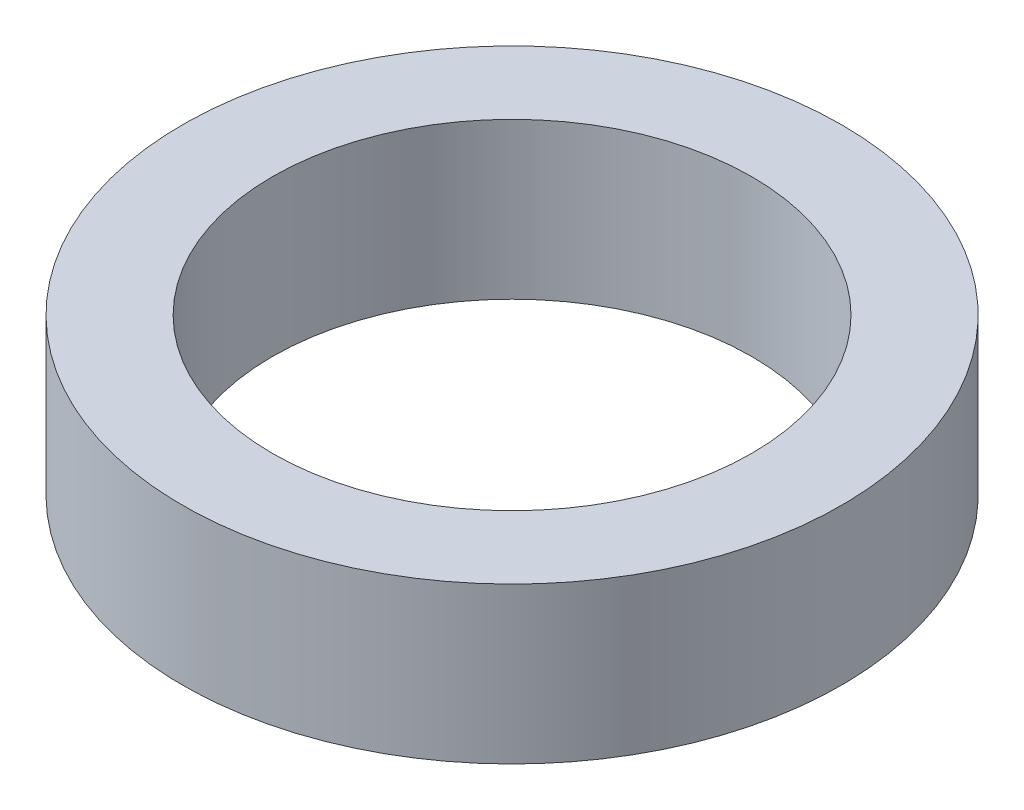
ISO-10303-21;
HEADER;
FILE_DESCRIPTION(('STEP AP214'),'2;1');
FILE_NAME('part.step','',(''),(''),'','','');
FILE_SCHEMA(('AUTOMOTIVE_DESIGN { 1 0 10303 214 1 1 1 1 }'));
ENDSEC;
DATA;
#1=APPLICATION_CONTEXT('core data for automotive mechanical design processes');
#2=APPLICATION_PROTOCOL_DEFINITION('international standard','automotive_design',2000,#1);
#3=PRODUCT_CONTEXT('',#1,'mechanical');
#4=PRODUCT('Part','Part','',(#3));
#5=PRODUCT_RELATED_PRODUCT_CATEGORY('part','',(#4));
#6=PRODUCT_DEFINITION_FORMATION('','',#4);
#7=PRODUCT_DEFINITION_CONTEXT('part definition',#1,'design');
#8=PRODUCT_DEFINITION('design','',#6,#7);
#9=PRODUCT_DEFINITION_SHAPE('','',#8);
#10=(LENGTH_UNIT() NAMED_UNIT(*) SI_UNIT(.MILLI.,.METRE.));
#11=(NAMED_UNIT(*) PLANE_ANGLE_UNIT() SI_UNIT($,.RADIAN.));
#12=(NAMED_UNIT(*) SI_UNIT($,.STERADIAN.) SOLID_ANGLE_UNIT());
#13=UNCERTAINTY_MEASURE_WITH_UNIT(LENGTH_MEASURE(1.E-05),#10,'distance_accuracy_value','');
#14=(GEOMETRIC_REPRESENTATION_CONTEXT(3) GLOBAL_UNCERTAINTY_ASSIGNED_CONTEXT((#13)) GLOBAL_UNIT_ASSIGNED_CONTEXT((#10,
#11,#12)) REPRESENTATION_CONTEXT('',''));
#15=CARTESIAN_POINT('',(0.,0.,0.));
#16=DIRECTION('',(0.,0.,1.));
#17=DIRECTION('',(1.,0.,0.));
#18=AXIS2_PLACEMENT_3D('',#15,#16,#17);
#19=CARTESIAN_POINT('',(0.,26.,0.));
#20=DIRECTION('',(0.,-1.,0.));
#21=DIRECTION('',(0.,0.,-1.));
#22=AXIS2_PLACEMENT_3D('',#19,#20,#21);
#23=CYLINDRICAL_SURFACE('',#22,55.);
#24=CARTESIAN_POINT('',(0.,26.,0.));
#25=DIRECTION('',(0.,1.,0.));
#26=DIRECTION('',(0.,0.,1.));
#27=AXIS2_PLACEMENT_3D('',#24,#25,#26);
#28=CIRCLE('',#27,55.);
#29=CARTESIAN_POINT('',(0.,26.,-55.));
#30=VERTEX_POINT('',#29);
#31=EDGE_CURVE('E10',#30,#30,#28,.T.);
#32=CARTESIAN_POINT('',(0.,0.,0.));
#33=DIRECTION('',(0.,1.,0.));
#34=DIRECTION('',(0.,0.,1.));
#35=AXIS2_PLACEMENT_3D('',#32,#33,#34);
#36=CIRCLE('',#35,55.);
#37=CARTESIAN_POINT('',(0.,0.,-55.));
#38=VERTEX_POINT('',#37);
#39=EDGE_CURVE('E37',#38,#38,#36,.T.);
#40=CARTESIAN_POINT('',(0.,26.,-55.));
#41=CARTESIAN_POINT('',(0.,25.7291666666667,-55.));
#42=CARTESIAN_POINT('',(0.,25.4583333333333,-55.));
#43=CARTESIAN_POINT('',(0.,24.9166666666667,-55.));
#44=CARTESIAN_POINT('',(0.,24.6458333333333,-55.));
#45=CARTESIAN_POINT('',(0.,24.1041666666667,-55.));
#46=CARTESIAN_POINT('',(0.,23.8333333333333,-55.));
#47=CARTESIAN_POINT('',(0.,23.2916666666667,-55.));
#48=CARTESIAN_POINT('',(0.,23.0208333333333,-55.));
#49=CARTESIAN_POINT('',(0.,22.4791666666667,-55.));
#50=CARTESIAN_POINT('',(0.,22.2083333333333,-55.));
#51=CARTESIAN_POINT('',(0.,21.6666666666667,-55.));
#52=CARTESIAN_POINT('',(0.,21.3958333333333,-55.));
#53=CARTESIAN_POINT('',(0.,20.8541666666667,-55.));
#54=CARTESIAN_POINT('',(0.,20.5833333333333,-55.));
#55=CARTESIAN_POINT('',(0.,20.0416666666667,-55.));
#56=CARTESIAN_POINT('',(0.,19.7708333333333,-55.));
#57=CARTESIAN_POINT('',(0.,19.2291666666667,-55.));
#58=CARTESIAN_POINT('',(0.,18.9583333333333,-55.));
#59=CARTESIAN_POINT('',(0.,18.4166666666667,-55.));
#60=CARTESIAN_POINT('',(0.,18.1458333333333,-55.));
#61=CARTESIAN_POINT('',(0.,17.6041666666667,-55.));
#62=CARTESIAN_POINT('',(0.,17.3333333333333,-55.));
#63=CARTESIAN_POINT('',(0.,16.7916666666667,-55.));
#64=CARTESIAN_POINT('',(0.,16.5208333333333,-55.));
#65=CARTESIAN_POINT('',(0.,15.9791666666667,-55.));
#66=CARTESIAN_POINT('',(0.,15.7083333333333,-55.));
#67=CARTESIAN_POINT('',(0.,15.1666666666667,-55.));
#68=CARTESIAN_POINT('',(0.,14.8958333333333,-55.));
#69=CARTESIAN_POINT('',(0.,14.3541666666667,-55.));
#70=CARTESIAN_POINT('',(0.,14.0833333333333,-55.));
#71=CARTESIAN_POINT('',(0.,13.5416666666667,-55.));
#72=CARTESIAN_POINT('',(0.,13.2708333333333,-55.));
#73=CARTESIAN_POINT('',(0.,12.7291666666667,-55.));
#74=CARTESIAN_POINT('',(0.,12.4583333333333,-55.));
#75=CARTESIAN_POINT('',(0.,11.9166666666667,-55.));
#76=CARTESIAN_POINT('',(0.,11.6458333333333,-55.));
#77=CARTESIAN_POINT('',(0.,11.1041666666667,-55.));
#78=CARTESIAN_POINT('',(0.,10.8333333333333,-55.));
#79=CARTESIAN_POINT('',(0.,10.2916666666667,-55.));
#80=CARTESIAN_POINT('',(0.,10.0208333333333,-55.));
#81=CARTESIAN_POINT('',(0.,9.47916666666667,-55.));
#82=CARTESIAN_POINT('',(0.,9.20833333333333,-55.));
#83=CARTESIAN_POINT('',(0.,8.66666666666667,-55.));
#84=CARTESIAN_POINT('',(0.,8.39583333333333,-55.));
#85=CARTESIAN_POINT('',(0.,7.85416666666667,-55.));
#86=CARTESIAN_POINT('',(0.,7.58333333333333,-55.));
#87=CARTESIAN_POINT('',(0.,7.04166666666667,-55.));
#88=CARTESIAN_POINT('',(0.,6.77083333333333,-55.));
#89=CARTESIAN_POINT('',(0.,6.22916666666667,-55.));
#90=CARTESIAN_POINT('',(0.,5.95833333333333,-55.));
#91=CARTESIAN_POINT('',(0.,5.41666666666667,-55.));
#92=CARTESIAN_POINT('',(0.,5.14583333333333,-55.));
#93=CARTESIAN_POINT('',(0.,4.60416666666667,-55.));
#94=CARTESIAN_POINT('',(0.,4.33333333333333,-55.));
#95=CARTESIAN_POINT('',(0.,3.79166666666667,-55.));
#96=CARTESIAN_POINT('',(0.,3.52083333333333,-55.));
#97=CARTESIAN_POINT('',(0.,2.97916666666667,-55.));
#98=CARTESIAN_POINT('',(0.,2.70833333333333,-55.));
#99=CARTESIAN_POINT('',(0.,2.16666666666667,-55.));
#100=CARTESIAN_POINT('',(0.,1.89583333333333,-55.));
#101=CARTESIAN_POINT('',(0.,1.35416666666667,-55.));
#102=CARTESIAN_POINT('',(0.,1.08333333333333,-55.));
#103=CARTESIAN_POINT('',(0.,0.541666666666667,-55.));
#104=CARTESIAN_POINT('',(0.,0.270833333333334,-55.));
#105=CARTESIAN_POINT('',(0.,0.,-55.));
#106=B_SPLINE_CURVE_WITH_KNOTS('',3,(#40,#41,#42,#43,#44,#45,#46,#47,#48,#49,#50,#51,#52,#53,
#54,#55,#56,#57,#58,#59,#60,#61,#62,#63,#64,#65,#66,#67,#68,#69,#70,#71,#72,#73,#74,#75,#76,#77,
#78,#79,#80,#81,#82,#83,#84,#85,#86,#87,#88,#89,#90,#91,#92,#93,#94,#95,#96,#97,#98,#99,#100,
#101,#102,#103,#104,#105),.UNSPECIFIED.,.F.,.F.,(4,2,2,2,2,2,2,2,2,2,2,2,2,2,2,2,2,2,2,2,2,2,2,
2,2,2,2,2,2,2,2,2,4),(0.,0.812500000000001,1.625,2.4375,3.25,4.0625,4.875,5.6875,6.5,7.3125,
8.125,8.9375,9.75,10.5625,11.375,12.1875,13.,13.8125,14.625,15.4375,16.25,17.0625,17.875,
18.6875,19.5,20.3125,21.125,21.9375,22.75,23.5625,24.375,25.1875,26.),.UNSPECIFIED.);
#107=EDGE_CURVE('BSEAM40',#30,#38,#106,.T.);
#108=ORIENTED_EDGE('',*,*,#31,.F.);
#109=ORIENTED_EDGE('',*,*,#39,.T.);
#110=ORIENTED_EDGE('',*,*,#107,.T.);
#111=ORIENTED_EDGE('',*,*,#107,.F.);
#112=EDGE_LOOP('',(#108,#110,#109,#111));
#113=FACE_BOUND('',#112,.T.);
#114=ADVANCED_FACE('F40',(#113),#23,.T.);
#115=CARTESIAN_POINT('',(0.,26.,0.));
#116=DIRECTION('',(0.,1.,0.));
#117=DIRECTION('',(0.,0.,1.));
#118=AXIS2_PLACEMENT_3D('',#115,#116,#117);
#119=PLANE('',#118);
#120=CARTESIAN_POINT('',(0.,26.,0.));
#121=DIRECTION('',(0.,1.,0.));
#122=DIRECTION('',(0.,0.,1.));
#123=AXIS2_PLACEMENT_3D('',#120,#121,#122);
#124=CIRCLE('',#123,40.);
#125=CARTESIAN_POINT('',(0.,26.,-40.));
#126=VERTEX_POINT('',#125);
#127=EDGE_CURVE('E50',#126,#126,#124,.T.);
#128=ORIENTED_EDGE('',*,*,#127,.F.);
#129=EDGE_LOOP('',(#128));
#130=FACE_BOUND('',#129,.T.);
#131=ORIENTED_EDGE('',*,*,#31,.T.);
#132=EDGE_LOOP('',(#131));
#133=FACE_BOUND('',#132,.T.);
#134=ADVANCED_FACE('F59',(#130,#133),#119,.T.);
#135=CARTESIAN_POINT('',(0.,0.,0.));
#136=DIRECTION('',(0.,1.,0.));
#137=DIRECTION('',(0.,0.,1.));
#138=AXIS2_PLACEMENT_3D('',#135,#136,#137);
#139=PLANE('',#138);
#140=CARTESIAN_POINT('',(0.,0.,0.));
#141=DIRECTION('',(0.,1.,0.));
#142=DIRECTION('',(0.,0.,1.));
#143=AXIS2_PLACEMENT_3D('',#140,#141,#142);
#144=CIRCLE('',#143,40.);
#145=CARTESIAN_POINT('',(0.,0.,-40.));
#146=VERTEX_POINT('',#145);
#147=EDGE_CURVE('E47',#146,#146,#144,.T.);
#148=ORIENTED_EDGE('',*,*,#147,.T.);
#149=EDGE_LOOP('',(#148));
#150=FACE_BOUND('',#149,.T.);
#151=ORIENTED_EDGE('',*,*,#39,.F.);
#152=EDGE_LOOP('',(#151));
#153=FACE_BOUND('',#152,.T.);
#154=ADVANCED_FACE('F58',(#150,#153),#139,.F.);
#155=CARTESIAN_POINT('',(0.,26.,0.));
#156=DIRECTION('',(0.,-1.,0.));
#157=DIRECTION('',(0.,0.,-1.));
#158=AXIS2_PLACEMENT_3D('',#155,#156,#157);
#159=CYLINDRICAL_SURFACE('',#158,40.);
#160=CARTESIAN_POINT('',(0.,26.,-40.));
#161=CARTESIAN_POINT('',(0.,25.7291666666667,-40.));
#162=CARTESIAN_POINT('',(0.,25.4583333333333,-40.));
#163=CARTESIAN_POINT('',(0.,24.9166666666667,-40.));
#164=CARTESIAN_POINT('',(0.,24.6458333333333,-40.));
#165=CARTESIAN_POINT('',(0.,24.1041666666667,-40.));
#166=CARTESIAN_POINT('',(0.,23.8333333333333,-40.));
#167=CARTESIAN_POINT('',(0.,23.2916666666667,-40.));
#168=CARTESIAN_POINT('',(0.,23.0208333333333,-40.));
#169=CARTESIAN_POINT('',(0.,22.4791666666667,-40.));
#170=CARTESIAN_POINT('',(0.,22.2083333333333,-40.));
#171=CARTESIAN_POINT('',(0.,21.6666666666667,-40.));
#172=CARTESIAN_POINT('',(0.,21.3958333333333,-40.));
#173=CARTESIAN_POINT('',(0.,20.8541666666667,-40.));
#174=CARTESIAN_POINT('',(0.,20.5833333333333,-40.));
#175=CARTESIAN_POINT('',(0.,20.0416666666667,-40.));
#176=CARTESIAN_POINT('',(0.,19.7708333333333,-40.));
#177=CARTESIAN_POINT('',(0.,19.2291666666667,-40.));
#178=CARTESIAN_POINT('',(0.,18.9583333333333,-40.));
#179=CARTESIAN_POINT('',(0.,18.4166666666667,-40.));
#180=CARTESIAN_POINT('',(0.,18.1458333333333,-40.));
#181=CARTESIAN_POINT('',(0.,17.6041666666667,-40.));
#182=CARTESIAN_POINT('',(0.,17.3333333333333,-40.));
#183=CARTESIAN_POINT('',(0.,16.7916666666667,-40.));
#184=CARTESIAN_POINT('',(0.,16.5208333333333,-40.));
#185=CARTESIAN_POINT('',(0.,15.9791666666667,-40.));
#186=CARTESIAN_POINT('',(0.,15.7083333333333,-40.));
#187=CARTESIAN_POINT('',(0.,15.1666666666667,-40.));
#188=CARTESIAN_POINT('',(0.,14.8958333333333,-40.));
#189=CARTESIAN_POINT('',(0.,14.3541666666667,-40.));
#190=CARTESIAN_POINT('',(0.,14.0833333333333,-40.));
#191=CARTESIAN_POINT('',(0.,13.5416666666667,-40.));
#192=CARTESIAN_POINT('',(0.,13.2708333333333,-40.));
#193=CARTESIAN_POINT('',(0.,12.7291666666667,-40.));
#194=CARTESIAN_POINT('',(0.,12.4583333333333,-40.));
#195=CARTESIAN_POINT('',(0.,11.9166666666667,-40.));
#196=CARTESIAN_POINT('',(0.,11.6458333333333,-40.));
#197=CARTESIAN_POINT('',(0.,11.1041666666667,-40.));
#198=CARTESIAN_POINT('',(0.,10.8333333333333,-40.));
#199=CARTESIAN_POINT('',(0.,10.2916666666667,-40.));
#200=CARTESIAN_POINT('',(0.,10.0208333333333,-40.));
#201=CARTESIAN_POINT('',(0.,9.47916666666667,-40.));
#202=CARTESIAN_POINT('',(0.,9.20833333333333,-40.));
#203=CARTESIAN_POINT('',(0.,8.66666666666667,-40.));
#204=CARTESIAN_POINT('',(0.,8.39583333333333,-40.));
#205=CARTESIAN_POINT('',(0.,7.85416666666667,-40.));
#206=CARTESIAN_POINT('',(0.,7.58333333333333,-40.));
#207=CARTESIAN_POINT('',(0.,7.04166666666667,-40.));
#208=CARTESIAN_POINT('',(0.,6.77083333333333,-40.));
#209=CARTESIAN_POINT('',(0.,6.22916666666667,-40.));
#210=CARTESIAN_POINT('',(0.,5.95833333333333,-40.));
#211=CARTESIAN_POINT('',(0.,5.41666666666667,-40.));
#212=CARTESIAN_POINT('',(0.,5.14583333333333,-40.));
#213=CARTESIAN_POINT('',(0.,4.60416666666667,-40.));
#214=CARTESIAN_POINT('',(0.,4.33333333333333,-40.));
#215=CARTESIAN_POINT('',(0.,3.79166666666667,-40.));
#216=CARTESIAN_POINT('',(0.,3.52083333333333,-40.));
#217=CARTESIAN_POINT('',(0.,2.97916666666667,-40.));
#218=CARTESIAN_POINT('',(0.,2.70833333333333,-40.));
#219=CARTESIAN_POINT('',(0.,2.16666666666667,-40.));
#220=CARTESIAN_POINT('',(0.,1.89583333333333,-40.));
#221=CARTESIAN_POINT('',(0.,1.35416666666667,-40.));
#222=CARTESIAN_POINT('',(0.,1.08333333333333,-40.));
#223=CARTESIAN_POINT('',(0.,0.541666666666667,-40.));
#224=CARTESIAN_POINT('',(0.,0.270833333333334,-40.));
#225=CARTESIAN_POINT('',(0.,0.,-40.));
#226=B_SPLINE_CURVE_WITH_KNOTS('',3,(#160,#161,#162,#163,#164,#165,#166,#167,#168,#169,#170,
#171,#172,#173,#174,#175,#176,#177,#178,#179,#180,#181,#182,#183,#184,#185,#186,#187,#188,#189,
#190,#191,#192,#193,#194,#195,#196,#197,#198,#199,#200,#201,#202,#203,#204,#205,#206,#207,#208,
#209,#210,#211,#212,#213,#214,#215,#216,#217,#218,#219,#220,#221,#222,#223,#224,#225),
.UNSPECIFIED.,.F.,.F.,(4,2,2,2,2,2,2,2,2,2,2,2,2,2,2,2,2,2,2,2,2,2,2,2,2,2,2,2,2,2,2,2,4),(0.,
0.812500000000001,1.625,2.4375,3.25,4.0625,4.875,5.6875,6.5,7.3125,8.125,8.9375,9.75,10.5625,
11.375,12.1875,13.,13.8125,14.625,15.4375,16.25,17.0625,17.875,18.6875,19.5,20.3125,21.125,
21.9375,22.75,23.5625,24.375,25.1875,26.),.UNSPECIFIED.);
#227=EDGE_CURVE('BSEAM54',#126,#146,#226,.T.);
#228=ORIENTED_EDGE('',*,*,#127,.T.);
#229=ORIENTED_EDGE('',*,*,#147,.F.);
#230=ORIENTED_EDGE('',*,*,#227,.T.);
#231=ORIENTED_EDGE('',*,*,#227,.F.);
#232=EDGE_LOOP('',(#228,#230,#229,#231));
#233=FACE_BOUND('',#232,.T.);
#234=ADVANCED_FACE('F54',(#233),#159,.F.);
#235=CLOSED_SHELL('',(#114,#134,#154,#234));
#236=MANIFOLD_SOLID_BREP('B2',#235);
#237=ADVANCED_BREP_SHAPE_REPRESENTATION('',(#18,#236),#14);
#238=SHAPE_DEFINITION_REPRESENTATION(#9,#237);
ENDSEC;
END-ISO-10303-21;
